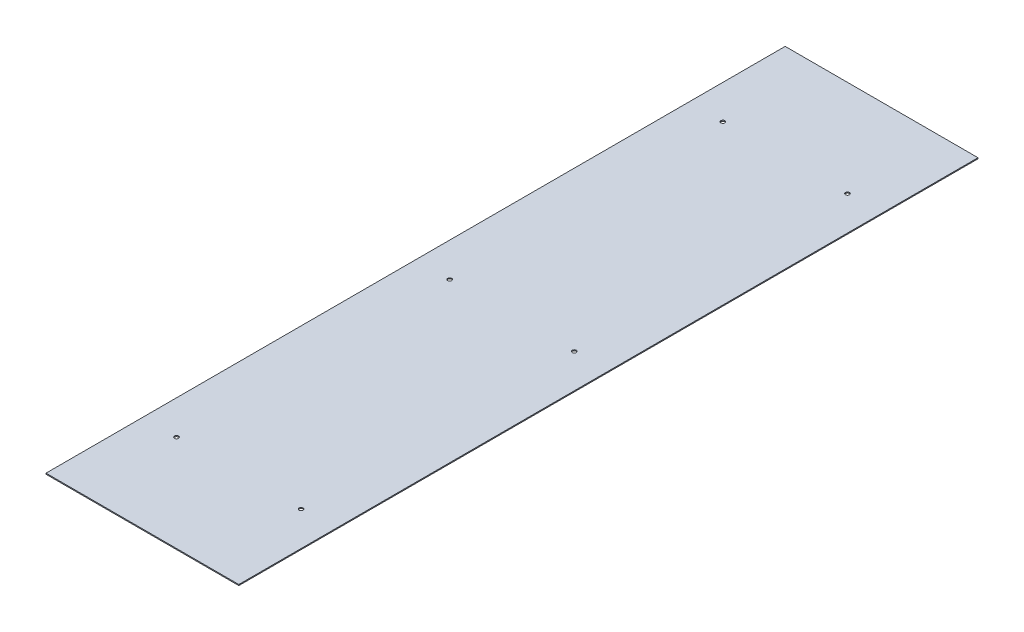
ISO-10303-21;
HEADER;
FILE_DESCRIPTION(('STEP AP214'),'2;1');
FILE_NAME('part.step','',(''),(''),'','','');
FILE_SCHEMA(('AUTOMOTIVE_DESIGN { 1 0 10303 214 1 1 1 1 }'));
ENDSEC;
DATA;
#1=APPLICATION_CONTEXT('core data for automotive mechanical design processes');
#2=APPLICATION_PROTOCOL_DEFINITION('international standard','automotive_design',2000,#1);
#3=PRODUCT_CONTEXT('',#1,'mechanical');
#4=PRODUCT('Part','Part','',(#3));
#5=PRODUCT_RELATED_PRODUCT_CATEGORY('part','',(#4));
#6=PRODUCT_DEFINITION_FORMATION('','',#4);
#7=PRODUCT_DEFINITION_CONTEXT('part definition',#1,'design');
#8=PRODUCT_DEFINITION('design','',#6,#7);
#9=PRODUCT_DEFINITION_SHAPE('','',#8);
#10=(LENGTH_UNIT() NAMED_UNIT(*) SI_UNIT(.MILLI.,.METRE.));
#11=(NAMED_UNIT(*) PLANE_ANGLE_UNIT() SI_UNIT($,.RADIAN.));
#12=(NAMED_UNIT(*) SI_UNIT($,.STERADIAN.) SOLID_ANGLE_UNIT());
#13=UNCERTAINTY_MEASURE_WITH_UNIT(LENGTH_MEASURE(1.E-05),#10,'distance_accuracy_value','');
#14=(GEOMETRIC_REPRESENTATION_CONTEXT(3) GLOBAL_UNCERTAINTY_ASSIGNED_CONTEXT((#13)) GLOBAL_UNIT_ASSIGNED_CONTEXT((#10,
#11,#12)) REPRESENTATION_CONTEXT('',''));
#15=CARTESIAN_POINT('',(0.,0.,0.));
#16=DIRECTION('',(0.,0.,1.));
#17=DIRECTION('',(1.,0.,0.));
#18=AXIS2_PLACEMENT_3D('',#15,#16,#17);
#19=CARTESIAN_POINT('',(4380.94840105623,-1.5875,584.2));
#20=DIRECTION('',(-1.,0.,0.));
#21=DIRECTION('',(0.,0.,1.));
#22=AXIS2_PLACEMENT_3D('',#19,#20,#21);
#23=PLANE('',#22);
#24=DIRECTION('',(0.,0.,1.));
#25=VECTOR('',#24,1.);
#26=CARTESIAN_POINT('',(4380.94840105623,0.,584.2));
#27=LINE('',#26,#25);
#28=CARTESIAN_POINT('',(4380.94840105623,0.,0.));
#29=VERTEX_POINT('',#28);
#30=CARTESIAN_POINT('',(4380.94840105623,0.,1168.4));
#31=VERTEX_POINT('',#30);
#32=EDGE_CURVE('E102',#29,#31,#27,.T.);
#33=ORIENTED_EDGE('',*,*,#32,.F.);
#34=DIRECTION('',(0.,1.,0.));
#35=VECTOR('',#34,1.);
#36=CARTESIAN_POINT('',(4380.94840105623,-1.5875,0.));
#37=LINE('',#36,#35);
#38=CARTESIAN_POINT('',(4380.94840105623,-1.5875,0.));
#39=VERTEX_POINT('',#38);
#40=EDGE_CURVE('E9',#39,#29,#37,.T.);
#41=ORIENTED_EDGE('',*,*,#40,.F.);
#42=DIRECTION('',(0.,0.,1.));
#43=VECTOR('',#42,1.);
#44=CARTESIAN_POINT('',(4380.94840105623,-1.5875,584.2));
#45=LINE('',#44,#43);
#46=CARTESIAN_POINT('',(4380.94840105623,-1.5875,1168.4));
#47=VERTEX_POINT('',#46);
#48=EDGE_CURVE('E79',#39,#47,#45,.T.);
#49=ORIENTED_EDGE('',*,*,#48,.T.);
#50=DIRECTION('',(0.,1.,0.));
#51=VECTOR('',#50,1.);
#52=CARTESIAN_POINT('',(4380.94840105623,-1.5875,1168.4));
#53=LINE('',#52,#51);
#54=EDGE_CURVE('E38',#47,#31,#53,.T.);
#55=ORIENTED_EDGE('',*,*,#54,.T.);
#56=EDGE_LOOP('',(#33,#41,#49,#55));
#57=FACE_BOUND('',#56,.T.);
#58=ADVANCED_FACE('F14',(#57),#23,.T.);
#59=CARTESIAN_POINT('',(4533.34840105623,-1.5875,0.));
#60=DIRECTION('',(0.,0.,1.));
#61=DIRECTION('',(1.,0.,0.));
#62=AXIS2_PLACEMENT_3D('',#59,#60,#61);
#63=PLANE('',#62);
#64=DIRECTION('',(1.,0.,0.));
#65=VECTOR('',#64,1.);
#66=CARTESIAN_POINT('',(4533.34840105623,0.,0.));
#67=LINE('',#66,#65);
#68=CARTESIAN_POINT('',(4685.74840105623,0.,0.));
#69=VERTEX_POINT('',#68);
#70=EDGE_CURVE('E86',#29,#69,#67,.T.);
#71=ORIENTED_EDGE('',*,*,#70,.T.);
#72=DIRECTION('',(0.,1.,0.));
#73=VECTOR('',#72,1.);
#74=CARTESIAN_POINT('',(4685.74840105623,-1.5875,0.));
#75=LINE('',#74,#73);
#76=CARTESIAN_POINT('',(4685.74840105623,-1.5875,0.));
#77=VERTEX_POINT('',#76);
#78=EDGE_CURVE('E24',#77,#69,#75,.T.);
#79=ORIENTED_EDGE('',*,*,#78,.F.);
#80=DIRECTION('',(1.,0.,0.));
#81=VECTOR('',#80,1.);
#82=CARTESIAN_POINT('',(4533.34840105623,-1.5875,0.));
#83=LINE('',#82,#81);
#84=EDGE_CURVE('E73',#39,#77,#83,.T.);
#85=ORIENTED_EDGE('',*,*,#84,.F.);
#86=ORIENTED_EDGE('',*,*,#40,.T.);
#87=EDGE_LOOP('',(#71,#79,#85,#86));
#88=FACE_BOUND('',#87,.T.);
#89=ADVANCED_FACE('F84',(#88),#63,.F.);
#90=CARTESIAN_POINT('',(4685.74840105623,-1.5875,584.2));
#91=DIRECTION('',(-1.,0.,0.));
#92=DIRECTION('',(0.,0.,1.));
#93=AXIS2_PLACEMENT_3D('',#90,#91,#92);
#94=PLANE('',#93);
#95=DIRECTION('',(0.,0.,1.));
#96=VECTOR('',#95,1.);
#97=CARTESIAN_POINT('',(4685.74840105623,0.,584.2));
#98=LINE('',#97,#96);
#99=CARTESIAN_POINT('',(4685.74840105623,0.,1168.4));
#100=VERTEX_POINT('',#99);
#101=EDGE_CURVE('E108',#69,#100,#98,.T.);
#102=ORIENTED_EDGE('',*,*,#101,.T.);
#103=DIRECTION('',(0.,1.,0.));
#104=VECTOR('',#103,1.);
#105=CARTESIAN_POINT('',(4685.74840105623,-1.5875,1168.4));
#106=LINE('',#105,#104);
#107=CARTESIAN_POINT('',(4685.74840105623,-1.5875,1168.4));
#108=VERTEX_POINT('',#107);
#109=EDGE_CURVE('E56',#108,#100,#106,.T.);
#110=ORIENTED_EDGE('',*,*,#109,.F.);
#111=DIRECTION('',(0.,0.,1.));
#112=VECTOR('',#111,1.);
#113=CARTESIAN_POINT('',(4685.74840105623,-1.5875,584.2));
#114=LINE('',#113,#112);
#115=EDGE_CURVE('E78',#77,#108,#114,.T.);
#116=ORIENTED_EDGE('',*,*,#115,.F.);
#117=ORIENTED_EDGE('',*,*,#78,.T.);
#118=EDGE_LOOP('',(#102,#110,#116,#117));
#119=FACE_BOUND('',#118,.T.);
#120=ADVANCED_FACE('F91',(#119),#94,.F.);
#121=CARTESIAN_POINT('',(4533.34840105623,-1.5875,1168.4));
#122=DIRECTION('',(0.,0.,1.));
#123=DIRECTION('',(1.,0.,0.));
#124=AXIS2_PLACEMENT_3D('',#121,#122,#123);
#125=PLANE('',#124);
#126=DIRECTION('',(1.,0.,0.));
#127=VECTOR('',#126,1.);
#128=CARTESIAN_POINT('',(4533.34840105623,0.,1168.4));
#129=LINE('',#128,#127);
#130=EDGE_CURVE('E110',#31,#100,#129,.T.);
#131=ORIENTED_EDGE('',*,*,#130,.F.);
#132=ORIENTED_EDGE('',*,*,#54,.F.);
#133=DIRECTION('',(1.,0.,0.));
#134=VECTOR('',#133,1.);
#135=CARTESIAN_POINT('',(4533.34840105623,-1.5875,1168.4));
#136=LINE('',#135,#134);
#137=EDGE_CURVE('E93',#47,#108,#136,.T.);
#138=ORIENTED_EDGE('',*,*,#137,.T.);
#139=ORIENTED_EDGE('',*,*,#109,.T.);
#140=EDGE_LOOP('',(#131,#132,#138,#139));
#141=FACE_BOUND('',#140,.T.);
#142=ADVANCED_FACE('F169',(#141),#125,.T.);
#143=CARTESIAN_POINT('',(4533.34840105623,-1.5875,584.2));
#144=DIRECTION('',(0.,-1.,0.));
#145=DIRECTION('',(1.,0.,0.));
#146=AXIS2_PLACEMENT_3D('',#143,#144,#145);
#147=PLANE('',#146);
#148=CARTESIAN_POINT('',(4631.77340105623,-1.58750000000007,584.2));
#149=DIRECTION('',(0.,-1.,0.));
#150=DIRECTION('',(0.,0.,-1.));
#151=AXIS2_PLACEMENT_3D('',#148,#149,#150);
#152=CIRCLE('',#151,3.1749999999997);
#153=CARTESIAN_POINT('',(4631.77340105623,-1.58750000000007,581.025));
#154=VERTEX_POINT('',#153);
#155=EDGE_CURVE('E156',#154,#154,#152,.T.);
#156=ORIENTED_EDGE('',*,*,#155,.F.);
#157=EDGE_LOOP('',(#156));
#158=FACE_BOUND('',#157,.T.);
#159=CARTESIAN_POINT('',(4434.92340105623,-1.58750000000007,584.2));
#160=DIRECTION('',(0.,-1.,0.));
#161=DIRECTION('',(0.,0.,-1.));
#162=AXIS2_PLACEMENT_3D('',#159,#160,#161);
#163=CIRCLE('',#162,3.1749999999997);
#164=CARTESIAN_POINT('',(4434.92340105623,-1.58750000000007,581.025));
#165=VERTEX_POINT('',#164);
#166=EDGE_CURVE('E139',#165,#165,#163,.T.);
#167=ORIENTED_EDGE('',*,*,#166,.F.);
#168=EDGE_LOOP('',(#167));
#169=FACE_BOUND('',#168,.T.);
#170=CARTESIAN_POINT('',(4631.77340105623,-1.58750000000007,152.4));
#171=DIRECTION('',(0.,-1.,0.));
#172=DIRECTION('',(0.,0.,-1.));
#173=AXIS2_PLACEMENT_3D('',#170,#171,#172);
#174=CIRCLE('',#173,3.1749999999997);
#175=CARTESIAN_POINT('',(4631.77340105623,-1.58750000000007,149.225));
#176=VERTEX_POINT('',#175);
#177=EDGE_CURVE('E135',#176,#176,#174,.T.);
#178=ORIENTED_EDGE('',*,*,#177,.F.);
#179=EDGE_LOOP('',(#178));
#180=FACE_BOUND('',#179,.T.);
#181=CARTESIAN_POINT('',(4434.92340105623,-1.58750000000007,152.4));
#182=DIRECTION('',(0.,-1.,0.));
#183=DIRECTION('',(0.,0.,-1.));
#184=AXIS2_PLACEMENT_3D('',#181,#182,#183);
#185=CIRCLE('',#184,3.1749999999997);
#186=CARTESIAN_POINT('',(4434.92340105623,-1.58750000000007,149.225));
#187=VERTEX_POINT('',#186);
#188=EDGE_CURVE('E131',#187,#187,#185,.T.);
#189=ORIENTED_EDGE('',*,*,#188,.F.);
#190=EDGE_LOOP('',(#189));
#191=FACE_BOUND('',#190,.T.);
#192=CARTESIAN_POINT('',(4631.77340105623,-1.58750000000007,1016.));
#193=DIRECTION('',(0.,-1.,0.));
#194=DIRECTION('',(0.,0.,-1.));
#195=AXIS2_PLACEMENT_3D('',#192,#193,#194);
#196=CIRCLE('',#195,3.1749999999997);
#197=CARTESIAN_POINT('',(4631.77340105623,-1.58750000000007,1012.825));
#198=VERTEX_POINT('',#197);
#199=EDGE_CURVE('E126',#198,#198,#196,.T.);
#200=ORIENTED_EDGE('',*,*,#199,.F.);
#201=EDGE_LOOP('',(#200));
#202=FACE_BOUND('',#201,.T.);
#203=CARTESIAN_POINT('',(4434.92340105623,-1.58750000000007,1016.));
#204=DIRECTION('',(0.,-1.,0.));
#205=DIRECTION('',(0.,0.,-1.));
#206=AXIS2_PLACEMENT_3D('',#203,#204,#205);
#207=CIRCLE('',#206,3.1749999999997);
#208=CARTESIAN_POINT('',(4434.92340105623,-1.58750000000007,1012.825));
#209=VERTEX_POINT('',#208);
#210=EDGE_CURVE('E121',#209,#209,#207,.T.);
#211=ORIENTED_EDGE('',*,*,#210,.F.);
#212=EDGE_LOOP('',(#211));
#213=FACE_BOUND('',#212,.T.);
#214=ORIENTED_EDGE('',*,*,#48,.F.);
#215=ORIENTED_EDGE('',*,*,#84,.T.);
#216=ORIENTED_EDGE('',*,*,#115,.T.);
#217=ORIENTED_EDGE('',*,*,#137,.F.);
#218=EDGE_LOOP('',(#214,#215,#216,#217));
#219=FACE_BOUND('',#218,.T.);
#220=ADVANCED_FACE('F75',(#158,#169,#180,#191,#202,#213,#219),#147,.T.);
#221=CARTESIAN_POINT('',(4533.34840105623,0.,584.2));
#222=DIRECTION('',(0.,-1.,0.));
#223=DIRECTION('',(1.,0.,0.));
#224=AXIS2_PLACEMENT_3D('',#221,#222,#223);
#225=PLANE('',#224);
#226=CARTESIAN_POINT('',(4631.77340105623,0.,584.2));
#227=DIRECTION('',(0.,-1.,0.));
#228=DIRECTION('',(0.,0.,-1.));
#229=AXIS2_PLACEMENT_3D('',#226,#227,#228);
#230=CIRCLE('',#229,3.1749999999997);
#231=CARTESIAN_POINT('',(4631.77340105623,0.,581.025));
#232=VERTEX_POINT('',#231);
#233=EDGE_CURVE('E17',#232,#232,#230,.F.);
#234=ORIENTED_EDGE('',*,*,#233,.F.);
#235=EDGE_LOOP('',(#234));
#236=FACE_BOUND('',#235,.T.);
#237=CARTESIAN_POINT('',(4434.92340105623,0.,584.2));
#238=DIRECTION('',(0.,-1.,0.));
#239=DIRECTION('',(0.,0.,-1.));
#240=AXIS2_PLACEMENT_3D('',#237,#238,#239);
#241=CIRCLE('',#240,3.1749999999997);
#242=CARTESIAN_POINT('',(4434.92340105623,0.,581.025));
#243=VERTEX_POINT('',#242);
#244=EDGE_CURVE('E136',#243,#243,#241,.F.);
#245=ORIENTED_EDGE('',*,*,#244,.F.);
#246=EDGE_LOOP('',(#245));
#247=FACE_BOUND('',#246,.T.);
#248=CARTESIAN_POINT('',(4631.77340105623,0.,152.4));
#249=DIRECTION('',(0.,-1.,0.));
#250=DIRECTION('',(0.,0.,-1.));
#251=AXIS2_PLACEMENT_3D('',#248,#249,#250);
#252=CIRCLE('',#251,3.1749999999997);
#253=CARTESIAN_POINT('',(4631.77340105623,0.,149.225));
#254=VERTEX_POINT('',#253);
#255=EDGE_CURVE('E132',#254,#254,#252,.F.);
#256=ORIENTED_EDGE('',*,*,#255,.F.);
#257=EDGE_LOOP('',(#256));
#258=FACE_BOUND('',#257,.T.);
#259=CARTESIAN_POINT('',(4434.92340105623,0.,152.4));
#260=DIRECTION('',(0.,-1.,0.));
#261=DIRECTION('',(0.,0.,-1.));
#262=AXIS2_PLACEMENT_3D('',#259,#260,#261);
#263=CIRCLE('',#262,3.1749999999997);
#264=CARTESIAN_POINT('',(4434.92340105623,0.,149.225));
#265=VERTEX_POINT('',#264);
#266=EDGE_CURVE('E127',#265,#265,#263,.F.);
#267=ORIENTED_EDGE('',*,*,#266,.F.);
#268=EDGE_LOOP('',(#267));
#269=FACE_BOUND('',#268,.T.);
#270=CARTESIAN_POINT('',(4631.77340105623,0.,1016.));
#271=DIRECTION('',(0.,-1.,0.));
#272=DIRECTION('',(0.,0.,-1.));
#273=AXIS2_PLACEMENT_3D('',#270,#271,#272);
#274=CIRCLE('',#273,3.1749999999997);
#275=CARTESIAN_POINT('',(4631.77340105623,0.,1012.825));
#276=VERTEX_POINT('',#275);
#277=EDGE_CURVE('E122',#276,#276,#274,.F.);
#278=ORIENTED_EDGE('',*,*,#277,.F.);
#279=EDGE_LOOP('',(#278));
#280=FACE_BOUND('',#279,.T.);
#281=CARTESIAN_POINT('',(4434.92340105623,0.,1016.));
#282=DIRECTION('',(0.,-1.,0.));
#283=DIRECTION('',(0.,0.,-1.));
#284=AXIS2_PLACEMENT_3D('',#281,#282,#283);
#285=CIRCLE('',#284,3.1749999999997);
#286=CARTESIAN_POINT('',(4434.92340105623,0.,1012.825));
#287=VERTEX_POINT('',#286);
#288=EDGE_CURVE('E105',#287,#287,#285,.F.);
#289=ORIENTED_EDGE('',*,*,#288,.F.);
#290=EDGE_LOOP('',(#289));
#291=FACE_BOUND('',#290,.T.);
#292=ORIENTED_EDGE('',*,*,#32,.T.);
#293=ORIENTED_EDGE('',*,*,#130,.T.);
#294=ORIENTED_EDGE('',*,*,#101,.F.);
#295=ORIENTED_EDGE('',*,*,#70,.F.);
#296=EDGE_LOOP('',(#292,#293,#294,#295));
#297=FACE_BOUND('',#296,.T.);
#298=ADVANCED_FACE('F177',(#236,#247,#258,#269,#280,#291,#297),#225,.F.);
#299=CARTESIAN_POINT('',(4434.92340105623,1206.86962509218,1016.));
#300=DIRECTION('',(0.,-1.,0.));
#301=DIRECTION('',(0.,0.,-1.));
#302=AXIS2_PLACEMENT_3D('',#299,#300,#301);
#303=CYLINDRICAL_SURFACE('',#302,3.1749999999997);
#304=ORIENTED_EDGE('',*,*,#210,.T.);
#305=EDGE_LOOP('',(#304));
#306=FACE_BOUND('',#305,.T.);
#307=ORIENTED_EDGE('',*,*,#288,.T.);
#308=EDGE_LOOP('',(#307));
#309=FACE_BOUND('',#308,.T.);
#310=ADVANCED_FACE('F219',(#306,#309),#303,.F.);
#311=CARTESIAN_POINT('',(4631.77340105623,1206.86962509218,1016.));
#312=DIRECTION('',(0.,-1.,0.));
#313=DIRECTION('',(0.,0.,-1.));
#314=AXIS2_PLACEMENT_3D('',#311,#312,#313);
#315=CYLINDRICAL_SURFACE('',#314,3.1749999999997);
#316=ORIENTED_EDGE('',*,*,#199,.T.);
#317=EDGE_LOOP('',(#316));
#318=FACE_BOUND('',#317,.T.);
#319=ORIENTED_EDGE('',*,*,#277,.T.);
#320=EDGE_LOOP('',(#319));
#321=FACE_BOUND('',#320,.T.);
#322=ADVANCED_FACE('F229',(#318,#321),#315,.F.);
#323=CARTESIAN_POINT('',(4434.92340105623,1206.86962509218,152.4));
#324=DIRECTION('',(0.,-1.,0.));
#325=DIRECTION('',(0.,0.,-1.));
#326=AXIS2_PLACEMENT_3D('',#323,#324,#325);
#327=CYLINDRICAL_SURFACE('',#326,3.1749999999997);
#328=ORIENTED_EDGE('',*,*,#188,.T.);
#329=EDGE_LOOP('',(#328));
#330=FACE_BOUND('',#329,.T.);
#331=ORIENTED_EDGE('',*,*,#266,.T.);
#332=EDGE_LOOP('',(#331));
#333=FACE_BOUND('',#332,.T.);
#334=ADVANCED_FACE('F240',(#330,#333),#327,.F.);
#335=CARTESIAN_POINT('',(4631.77340105623,1206.86962509218,152.4));
#336=DIRECTION('',(0.,-1.,0.));
#337=DIRECTION('',(0.,0.,-1.));
#338=AXIS2_PLACEMENT_3D('',#335,#336,#337);
#339=CYLINDRICAL_SURFACE('',#338,3.1749999999997);
#340=ORIENTED_EDGE('',*,*,#177,.T.);
#341=EDGE_LOOP('',(#340));
#342=FACE_BOUND('',#341,.T.);
#343=ORIENTED_EDGE('',*,*,#255,.T.);
#344=EDGE_LOOP('',(#343));
#345=FACE_BOUND('',#344,.T.);
#346=ADVANCED_FACE('F251',(#342,#345),#339,.F.);
#347=CARTESIAN_POINT('',(4434.92340105623,1206.86962509218,584.2));
#348=DIRECTION('',(0.,-1.,0.));
#349=DIRECTION('',(0.,0.,-1.));
#350=AXIS2_PLACEMENT_3D('',#347,#348,#349);
#351=CYLINDRICAL_SURFACE('',#350,3.1749999999997);
#352=ORIENTED_EDGE('',*,*,#166,.T.);
#353=EDGE_LOOP('',(#352));
#354=FACE_BOUND('',#353,.T.);
#355=ORIENTED_EDGE('',*,*,#244,.T.);
#356=EDGE_LOOP('',(#355));
#357=FACE_BOUND('',#356,.T.);
#358=ADVANCED_FACE('F262',(#354,#357),#351,.F.);
#359=CARTESIAN_POINT('',(4631.77340105623,1206.86962509218,584.2));
#360=DIRECTION('',(0.,-1.,0.));
#361=DIRECTION('',(0.,0.,-1.));
#362=AXIS2_PLACEMENT_3D('',#359,#360,#361);
#363=CYLINDRICAL_SURFACE('',#362,3.1749999999997);
#364=ORIENTED_EDGE('',*,*,#155,.T.);
#365=EDGE_LOOP('',(#364));
#366=FACE_BOUND('',#365,.T.);
#367=ORIENTED_EDGE('',*,*,#233,.T.);
#368=EDGE_LOOP('',(#367));
#369=FACE_BOUND('',#368,.T.);
#370=ADVANCED_FACE('F272',(#366,#369),#363,.F.);
#371=CLOSED_SHELL('',(#58,#89,#120,#142,#220,#298,#310,#322,#334,#346,#358,#370));
#372=MANIFOLD_SOLID_BREP('B1',#371);
#373=ADVANCED_BREP_SHAPE_REPRESENTATION('',(#18,#372),#14);
#374=SHAPE_DEFINITION_REPRESENTATION(#9,#373);
ENDSEC;
END-ISO-10303-21;
